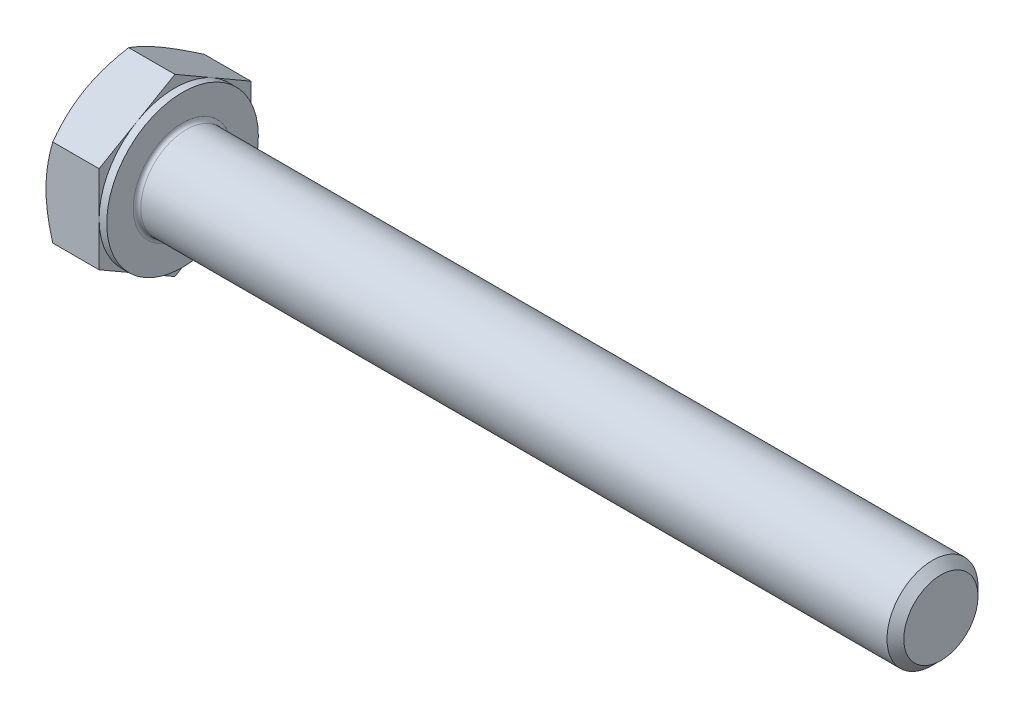
ISO-10303-21;
HEADER;
FILE_DESCRIPTION(('STEP AP214'),'2;1');
FILE_NAME('part.step','',(''),(''),'','','');
FILE_SCHEMA(('AUTOMOTIVE_DESIGN { 1 0 10303 214 1 1 1 1 }'));
ENDSEC;
DATA;
#1=APPLICATION_CONTEXT('core data for automotive mechanical design processes');
#2=APPLICATION_PROTOCOL_DEFINITION('international standard','automotive_design',2000,#1);
#3=PRODUCT_CONTEXT('',#1,'mechanical');
#4=PRODUCT('Part','Part','',(#3));
#5=PRODUCT_RELATED_PRODUCT_CATEGORY('part','',(#4));
#6=PRODUCT_DEFINITION_FORMATION('','',#4);
#7=PRODUCT_DEFINITION_CONTEXT('part definition',#1,'design');
#8=PRODUCT_DEFINITION('design','',#6,#7);
#9=PRODUCT_DEFINITION_SHAPE('','',#8);
#10=(LENGTH_UNIT() NAMED_UNIT(*) SI_UNIT(.MILLI.,.METRE.));
#11=(NAMED_UNIT(*) PLANE_ANGLE_UNIT() SI_UNIT($,.RADIAN.));
#12=(NAMED_UNIT(*) SI_UNIT($,.STERADIAN.) SOLID_ANGLE_UNIT());
#13=UNCERTAINTY_MEASURE_WITH_UNIT(LENGTH_MEASURE(1.E-05),#10,'distance_accuracy_value','');
#14=(GEOMETRIC_REPRESENTATION_CONTEXT(3) GLOBAL_UNCERTAINTY_ASSIGNED_CONTEXT((#13)) GLOBAL_UNIT_ASSIGNED_CONTEXT((#10,
#11,#12)) REPRESENTATION_CONTEXT('',''));
#15=CARTESIAN_POINT('',(0.,0.,0.));
#16=DIRECTION('',(0.,0.,1.));
#17=DIRECTION('',(1.,0.,0.));
#18=AXIS2_PLACEMENT_3D('',#15,#16,#17);
#19=CARTESIAN_POINT('',(4.,5.77350269189626,0.));
#20=DIRECTION('',(1.,0.,0.));
#21=DIRECTION('',(0.,0.,-1.));
#22=AXIS2_PLACEMENT_3D('',#19,#20,#21);
#23=PLANE('',#22);
#24=CARTESIAN_POINT('',(4.,0.,0.));
#25=DIRECTION('',(1.,0.,0.));
#26=DIRECTION('',(0.,0.,-1.));
#27=AXIS2_PLACEMENT_3D('',#24,#25,#26);
#28=CIRCLE('',#27,3.25);
#29=CARTESIAN_POINT('',(4.,0.,-3.25));
#30=VERTEX_POINT('',#29);
#31=EDGE_CURVE('E24',#30,#30,#28,.F.);
#32=ORIENTED_EDGE('',*,*,#31,.T.);
#33=EDGE_LOOP('',(#32));
#34=FACE_BOUND('',#33,.T.);
#35=CARTESIAN_POINT('',(4.,0.,0.));
#36=DIRECTION('',(1.,0.,0.));
#37=DIRECTION('',(0.,0.,-1.));
#38=AXIS2_PLACEMENT_3D('',#35,#36,#37);
#39=CIRCLE('',#38,5.);
#40=CARTESIAN_POINT('',(4.,0.,-5.));
#41=VERTEX_POINT('',#40);
#42=EDGE_CURVE('E282',#41,#41,#39,.T.);
#43=ORIENTED_EDGE('',*,*,#42,.T.);
#44=EDGE_LOOP('',(#43));
#45=FACE_BOUND('',#44,.T.);
#46=ADVANCED_FACE('F16',(#34,#45),#23,.T.);
#47=CARTESIAN_POINT('',(0.,0.,0.));
#48=DIRECTION('',(-1.,0.,0.));
#49=DIRECTION('',(0.,0.,1.));
#50=AXIS2_PLACEMENT_3D('',#47,#48,#49);
#51=CYLINDRICAL_SURFACE('',#50,3.);
#52=CARTESIAN_POINT('',(4.25,0.,0.));
#53=DIRECTION('',(1.,0.,0.));
#54=DIRECTION('',(0.,0.,-1.));
#55=AXIS2_PLACEMENT_3D('',#52,#53,#54);
#56=CIRCLE('',#55,3.);
#57=CARTESIAN_POINT('',(4.25,0.,-3.));
#58=VERTEX_POINT('',#57);
#59=EDGE_CURVE('E11',#58,#58,#56,.T.);
#60=ORIENTED_EDGE('',*,*,#59,.T.);
#61=EDGE_LOOP('',(#60));
#62=FACE_BOUND('',#61,.T.);
#63=CARTESIAN_POINT('',(53.4455,0.,0.));
#64=DIRECTION('',(-1.,0.,0.));
#65=DIRECTION('',(0.,0.,1.));
#66=AXIS2_PLACEMENT_3D('',#63,#64,#65);
#67=CIRCLE('',#66,3.);
#68=CARTESIAN_POINT('',(53.4455,0.,3.));
#69=VERTEX_POINT('',#68);
#70=EDGE_CURVE('E261',#69,#69,#67,.T.);
#71=ORIENTED_EDGE('',*,*,#70,.T.);
#72=EDGE_LOOP('',(#71));
#73=FACE_BOUND('',#72,.T.);
#74=ADVANCED_FACE('F235',(#62,#73),#51,.T.);
#75=CARTESIAN_POINT('',(54.,0.,0.));
#76=DIRECTION('',(-1.,0.,0.));
#77=DIRECTION('',(0.,0.,1.));
#78=AXIS2_PLACEMENT_3D('',#75,#76,#77);
#79=CONICAL_SURFACE('',#78,2.4455,0.785398163397435);
#80=ORIENTED_EDGE('',*,*,#70,.F.);
#81=EDGE_LOOP('',(#80));
#82=FACE_BOUND('',#81,.T.);
#83=CARTESIAN_POINT('',(54.,0.,0.));
#84=DIRECTION('',(-1.,0.,0.));
#85=DIRECTION('',(0.,0.,1.));
#86=AXIS2_PLACEMENT_3D('',#83,#84,#85);
#87=CIRCLE('',#86,2.4455);
#88=CARTESIAN_POINT('',(54.,0.,2.4455));
#89=VERTEX_POINT('',#88);
#90=EDGE_CURVE('E259',#89,#89,#87,.T.);
#91=ORIENTED_EDGE('',*,*,#90,.T.);
#92=EDGE_LOOP('',(#91));
#93=FACE_BOUND('',#92,.T.);
#94=ADVANCED_FACE('F240',(#82,#93),#79,.T.);
#95=CARTESIAN_POINT('',(54.,0.,0.));
#96=DIRECTION('',(-1.,0.,0.));
#97=DIRECTION('',(0.,0.,1.));
#98=AXIS2_PLACEMENT_3D('',#95,#96,#97);
#99=PLANE('',#98);
#100=ORIENTED_EDGE('',*,*,#90,.F.);
#101=EDGE_LOOP('',(#100));
#102=FACE_BOUND('',#101,.T.);
#103=ADVANCED_FACE('F247',(#102),#99,.F.);
#104=CARTESIAN_POINT('',(3.5,5.,0.));
#105=DIRECTION('',(1.,0.,0.));
#106=DIRECTION('',(0.,0.,-1.));
#107=AXIS2_PLACEMENT_3D('',#104,#105,#106);
#108=PLANE('',#107);
#109=DIRECTION('',(0.,0.5,0.866025403784438));
#110=VECTOR('',#109,1.);
#111=CARTESIAN_POINT('',(3.5,2.88675134594812,-5.));
#112=LINE('',#111,#110);
#113=CARTESIAN_POINT('',(3.5,2.88675134594812,-5.));
#114=VERTEX_POINT('',#113);
#115=CARTESIAN_POINT('',(3.5,4.33012701892219,-2.5));
#116=VERTEX_POINT('',#115);
#117=EDGE_CURVE('E148',#114,#116,#112,.T.);
#118=ORIENTED_EDGE('',*,*,#117,.T.);
#119=CARTESIAN_POINT('',(3.5,0.,0.));
#120=DIRECTION('',(-1.,0.,0.));
#121=DIRECTION('',(0.,0.,1.));
#122=AXIS2_PLACEMENT_3D('',#119,#120,#121);
#123=CIRCLE('',#122,5.);
#124=CARTESIAN_POINT('',(3.5,0.,-5.));
#125=VERTEX_POINT('',#124);
#126=EDGE_CURVE('E31',#116,#125,#123,.T.);
#127=ORIENTED_EDGE('',*,*,#126,.T.);
#128=DIRECTION('',(0.,1.,0.));
#129=VECTOR('',#128,1.);
#130=CARTESIAN_POINT('',(3.5,2.88675134594812,-5.));
#131=LINE('',#130,#129);
#132=EDGE_CURVE('E285',#125,#114,#131,.T.);
#133=ORIENTED_EDGE('',*,*,#132,.T.);
#134=EDGE_LOOP('',(#118,#127,#133));
#135=FACE_BOUND('',#134,.T.);
#136=ADVANCED_FACE('F250',(#135),#108,.T.);
#137=CARTESIAN_POINT('',(3.5,5.77350269189626,0.));
#138=VERTEX_POINT('',#137);
#139=EDGE_CURVE('E146',#116,#138,#112,.T.);
#140=ORIENTED_EDGE('',*,*,#139,.T.);
#141=DIRECTION('',(0.,-0.5,0.866025403784438));
#142=VECTOR('',#141,1.);
#143=CARTESIAN_POINT('',(3.5,5.77350269189626,0.));
#144=LINE('',#143,#142);
#145=CARTESIAN_POINT('',(3.5,4.33012701892219,2.5));
#146=VERTEX_POINT('',#145);
#147=EDGE_CURVE('E145',#138,#146,#144,.T.);
#148=ORIENTED_EDGE('',*,*,#147,.T.);
#149=EDGE_CURVE('E134',#146,#116,#123,.T.);
#150=ORIENTED_EDGE('',*,*,#149,.T.);
#151=EDGE_LOOP('',(#140,#148,#150));
#152=FACE_BOUND('',#151,.T.);
#153=ADVANCED_FACE('F255',(#152),#108,.T.);
#154=CARTESIAN_POINT('',(3.5,2.88675134594812,5.));
#155=VERTEX_POINT('',#154);
#156=EDGE_CURVE('E113',#146,#155,#144,.T.);
#157=ORIENTED_EDGE('',*,*,#156,.T.);
#158=DIRECTION('',(0.,-1.,0.));
#159=VECTOR('',#158,1.);
#160=CARTESIAN_POINT('',(3.5,2.88675134594812,5.));
#161=LINE('',#160,#159);
#162=CARTESIAN_POINT('',(3.5,0.,5.));
#163=VERTEX_POINT('',#162);
#164=EDGE_CURVE('E107',#155,#163,#161,.T.);
#165=ORIENTED_EDGE('',*,*,#164,.T.);
#166=EDGE_CURVE('E111',#163,#146,#123,.T.);
#167=ORIENTED_EDGE('',*,*,#166,.T.);
#168=EDGE_LOOP('',(#157,#165,#167));
#169=FACE_BOUND('',#168,.T.);
#170=ADVANCED_FACE('F109',(#169),#108,.T.);
#171=CARTESIAN_POINT('',(3.5,-2.88675134594812,5.));
#172=VERTEX_POINT('',#171);
#173=EDGE_CURVE('E117',#163,#172,#161,.T.);
#174=ORIENTED_EDGE('',*,*,#173,.T.);
#175=DIRECTION('',(0.,-0.5,-0.866025403784438));
#176=VECTOR('',#175,1.);
#177=CARTESIAN_POINT('',(3.5,-5.77350269189626,0.));
#178=LINE('',#177,#176);
#179=CARTESIAN_POINT('',(3.5,-4.33012701892219,2.5));
#180=VERTEX_POINT('',#179);
#181=EDGE_CURVE('E124',#172,#180,#178,.T.);
#182=ORIENTED_EDGE('',*,*,#181,.T.);
#183=EDGE_CURVE('E121',#180,#163,#123,.T.);
#184=ORIENTED_EDGE('',*,*,#183,.T.);
#185=EDGE_LOOP('',(#174,#182,#184));
#186=FACE_BOUND('',#185,.T.);
#187=ADVANCED_FACE('F122',(#186),#108,.T.);
#188=CARTESIAN_POINT('',(3.5,-5.77350269189626,0.));
#189=VERTEX_POINT('',#188);
#190=EDGE_CURVE('E140',#180,#189,#178,.T.);
#191=ORIENTED_EDGE('',*,*,#190,.T.);
#192=DIRECTION('',(0.,0.5,-0.866025403784439));
#193=VECTOR('',#192,1.);
#194=CARTESIAN_POINT('',(3.5,-2.88675134594813,-5.));
#195=LINE('',#194,#193);
#196=CARTESIAN_POINT('',(3.5,-4.3301270189222,-2.5));
#197=VERTEX_POINT('',#196);
#198=EDGE_CURVE('E323',#189,#197,#195,.T.);
#199=ORIENTED_EDGE('',*,*,#198,.T.);
#200=EDGE_CURVE('E128',#197,#180,#123,.T.);
#201=ORIENTED_EDGE('',*,*,#200,.T.);
#202=EDGE_LOOP('',(#191,#199,#201));
#203=FACE_BOUND('',#202,.T.);
#204=ADVANCED_FACE('F324',(#203),#108,.T.);
#205=CARTESIAN_POINT('',(3.5,-2.88675134594813,-5.));
#206=VERTEX_POINT('',#205);
#207=EDGE_CURVE('E135',#197,#206,#195,.T.);
#208=ORIENTED_EDGE('',*,*,#207,.T.);
#209=EDGE_CURVE('E286',#206,#125,#131,.T.);
#210=ORIENTED_EDGE('',*,*,#209,.T.);
#211=EDGE_CURVE('E293',#125,#197,#123,.T.);
#212=ORIENTED_EDGE('',*,*,#211,.T.);
#213=EDGE_LOOP('',(#208,#210,#212));
#214=FACE_BOUND('',#213,.T.);
#215=ADVANCED_FACE('F256',(#214),#108,.T.);
#216=CARTESIAN_POINT('',(0.,0.,0.));
#217=DIRECTION('',(-1.,0.,0.));
#218=DIRECTION('',(0.,0.,1.));
#219=AXIS2_PLACEMENT_3D('',#216,#217,#218);
#220=CYLINDRICAL_SURFACE('',#219,5.);
#221=ORIENTED_EDGE('',*,*,#126,.F.);
#222=ORIENTED_EDGE('',*,*,#149,.F.);
#223=ORIENTED_EDGE('',*,*,#166,.F.);
#224=ORIENTED_EDGE('',*,*,#183,.F.);
#225=ORIENTED_EDGE('',*,*,#200,.F.);
#226=ORIENTED_EDGE('',*,*,#211,.F.);
#227=EDGE_LOOP('',(#221,#222,#223,#224,#225,#226));
#228=FACE_BOUND('',#227,.T.);
#229=ORIENTED_EDGE('',*,*,#42,.F.);
#230=EDGE_LOOP('',(#229));
#231=FACE_BOUND('',#230,.T.);
#232=ADVANCED_FACE('F131',(#228,#231),#220,.T.);
#233=CARTESIAN_POINT('',(0.,5.77350269189626,0.));
#234=DIRECTION('',(1.,0.,0.));
#235=DIRECTION('',(0.,0.,-1.));
#236=AXIS2_PLACEMENT_3D('',#233,#234,#235);
#237=PLANE('',#236);
#238=CARTESIAN_POINT('',(0.,0.,0.));
#239=DIRECTION('',(1.,0.,0.));
#240=DIRECTION('',(0.,0.,-1.));
#241=AXIS2_PLACEMENT_3D('',#238,#239,#240);
#242=CIRCLE('',#241,5.);
#243=CARTESIAN_POINT('',(0.,0.,-5.));
#244=VERTEX_POINT('',#243);
#245=CARTESIAN_POINT('',(0.,4.33012701892219,-2.5));
#246=VERTEX_POINT('',#245);
#247=EDGE_CURVE('E281',#244,#246,#242,.T.);
#248=ORIENTED_EDGE('',*,*,#247,.F.);
#249=CARTESIAN_POINT('',(0.,-4.3301270189222,-2.5));
#250=VERTEX_POINT('',#249);
#251=EDGE_CURVE('E277',#250,#244,#242,.T.);
#252=ORIENTED_EDGE('',*,*,#251,.F.);
#253=CARTESIAN_POINT('',(0.,-4.33012701892219,2.5));
#254=VERTEX_POINT('',#253);
#255=EDGE_CURVE('E280',#254,#250,#242,.T.);
#256=ORIENTED_EDGE('',*,*,#255,.F.);
#257=CARTESIAN_POINT('',(0.,0.,5.));
#258=VERTEX_POINT('',#257);
#259=EDGE_CURVE('E316',#258,#254,#242,.T.);
#260=ORIENTED_EDGE('',*,*,#259,.F.);
#261=CARTESIAN_POINT('',(0.,0.,0.));
#262=DIRECTION('',(-1.,0.,0.));
#263=DIRECTION('',(0.,0.,1.));
#264=AXIS2_PLACEMENT_3D('',#261,#262,#263);
#265=CIRCLE('',#264,5.);
#266=CARTESIAN_POINT('',(0.,4.33012701892219,2.5));
#267=VERTEX_POINT('',#266);
#268=EDGE_CURVE('E149',#258,#267,#265,.T.);
#269=ORIENTED_EDGE('',*,*,#268,.T.);
#270=EDGE_CURVE('E339',#246,#267,#242,.T.);
#271=ORIENTED_EDGE('',*,*,#270,.F.);
#272=EDGE_LOOP('',(#248,#252,#256,#260,#269,#271));
#273=FACE_BOUND('',#272,.T.);
#274=ADVANCED_FACE('F180',(#273),#237,.F.);
#275=CARTESIAN_POINT('',(0.,0.,0.));
#276=DIRECTION('',(1.,0.,0.));
#277=DIRECTION('',(0.,0.,-1.));
#278=AXIS2_PLACEMENT_3D('',#275,#276,#277);
#279=CONICAL_SURFACE('',#278,5.,1.0471975511966);
#280=CARTESIAN_POINT('',(0.446648656051828,2.88663587589428,5.0002));
#281=CARTESIAN_POINT('',(0.373386567637635,3.01349970319368,4.78046540547482));
#282=CARTESIAN_POINT('',(0.306751321918093,3.14144859993849,4.55885141554042));
#283=CARTESIAN_POINT('',(0.190438991010812,3.39956193532121,4.11178600454649));
#284=CARTESIAN_POINT('',(0.14080304991579,3.52973095989718,3.88632664040923));
#285=CARTESIAN_POINT('',(0.0635510254186983,3.78847564779798,3.43816769477649));
#286=CARTESIAN_POINT('',(0.0354203782834897,3.91701101576052,3.21553790689581));
#287=CARTESIAN_POINT('',(0.0101949219536848,4.11026620624322,2.88081009815336));
#288=CARTESIAN_POINT('',(0.0046134597694843,4.17472868879311,2.76915780319494));
#289=CARTESIAN_POINT('',(-0.000797783248529451,4.30371322717528,2.5457500293262));
#290=CARTESIAN_POINT('',(-0.000627741741796315,4.36823528110589,2.43399455370969));
#291=CARTESIAN_POINT('',(0.00775363179203698,4.54500768479194,2.12781576914936));
#292=CARTESIAN_POINT('',(0.0218297718972523,4.65719946015293,1.93349391403279));
#293=CARTESIAN_POINT('',(0.0664652571094322,4.88083840557981,1.54613989800229));
#294=CARTESIAN_POINT('',(0.0970398601475096,4.9922847895602,1.35310909862843));
#295=CARTESIAN_POINT('',(0.173468493621166,5.21637431361295,0.964974657525145));
#296=CARTESIAN_POINT('',(0.219646378878682,5.32898917185759,0.769920001358263));
#297=CARTESIAN_POINT('',(0.324451794491937,5.55253939626498,0.38271965464123));
#298=CARTESIAN_POINT('',(0.383054703437377,5.66347762579592,0.190569004591912));
#299=CARTESIAN_POINT('',(0.446648656051831,5.7736181619501,-0.000200000000000734));
#300=B_SPLINE_CURVE_WITH_KNOTS('',3,(#280,#281,#282,#283,#284,#285,#286,#287,#288,#289,#290,
#291,#292,#293,#294,#295,#296,#297,#298,#299),.UNSPECIFIED.,.F.,.F.,(4,2,2,2,2,2,2,2,2,4),(0.,
0.792555841363091,1.58701660053334,2.36181537487281,2.74884076077326,3.13585419177295,
3.8096236259968,4.4840172390119,5.17336882348929,5.86136694793726),.UNSPECIFIED.);
#301=CARTESIAN_POINT('',(0.446581987385204,5.77350269189626,0.));
#302=VERTEX_POINT('',#301);
#303=EDGE_CURVE('E200',#267,#302,#300,.T.);
#304=ORIENTED_EDGE('',*,*,#303,.T.);
#305=CARTESIAN_POINT('',(0.446648656051831,5.7736181619501,0.000199999999999791));
#306=CARTESIAN_POINT('',(0.373386567637636,5.64675433465071,-0.219534594525184));
#307=CARTESIAN_POINT('',(0.306751321918093,5.5188054379059,-0.441148584459579));
#308=CARTESIAN_POINT('',(0.190438991010811,5.26069210252318,-0.888213995453511));
#309=CARTESIAN_POINT('',(0.140803049915789,5.13052307794721,-1.11367335959077));
#310=CARTESIAN_POINT('',(0.0635510254186972,4.87177839004641,-1.56183230522351));
#311=CARTESIAN_POINT('',(0.0354203782834882,4.74324302208387,-1.78446209310419));
#312=CARTESIAN_POINT('',(0.0101949219536831,4.54998783160116,-2.11918990184664));
#313=CARTESIAN_POINT('',(0.00461345976948256,4.48552534905128,-2.23084219680506));
#314=CARTESIAN_POINT('',(-0.000797783248530469,4.35654081066911,-2.4542499706738));
#315=CARTESIAN_POINT('',(-0.000627741741796585,4.2920187567385,-2.56600544629031));
#316=CARTESIAN_POINT('',(0.00775363179203711,4.11524635305244,-2.87218423085064));
#317=CARTESIAN_POINT('',(0.0218297718972509,4.00305457769146,-3.06650608596721));
#318=CARTESIAN_POINT('',(0.0664652571094294,3.77941563226457,-3.45386010199771));
#319=CARTESIAN_POINT('',(0.0970398601475071,3.66796924828418,-3.64689090137157));
#320=CARTESIAN_POINT('',(0.173468493621163,3.44387972423143,-4.03502534247485));
#321=CARTESIAN_POINT('',(0.21964637887868,3.3312648659868,-4.23007999864174));
#322=CARTESIAN_POINT('',(0.324451794491934,3.1077146415794,-4.61728034535877));
#323=CARTESIAN_POINT('',(0.383054703437374,2.99677641204846,-4.80943099540809));
#324=CARTESIAN_POINT('',(0.446648656051828,2.88663587589428,-5.0002));
#325=B_SPLINE_CURVE_WITH_KNOTS('',3,(#305,#306,#307,#308,#309,#310,#311,#312,#313,#314,#315,
#316,#317,#318,#319,#320,#321,#322,#323,#324),.UNSPECIFIED.,.F.,.F.,(4,2,2,2,2,2,2,2,2,4),(0.,
0.792555841363091,1.58701660053334,2.36181537487281,2.74884076077326,3.13585419177295,
3.8096236259968,4.4840172390119,5.17336882348929,5.86136694793726),.UNSPECIFIED.);
#326=EDGE_CURVE('E39',#302,#246,#325,.T.);
#327=ORIENTED_EDGE('',*,*,#326,.T.);
#328=ORIENTED_EDGE('',*,*,#270,.T.);
#329=EDGE_LOOP('',(#304,#327,#328));
#330=FACE_BOUND('',#329,.T.);
#331=ADVANCED_FACE('F340',(#330),#279,.T.);
#332=CARTESIAN_POINT('',(2.47533544689295,-7.82661640313889,5.));
#333=CARTESIAN_POINT('',(2.36879683507773,-7.60758613024921,5.));
#334=CARTESIAN_POINT('',(2.26325911833056,-7.38806071364409,5.));
#335=CARTESIAN_POINT('',(2.05474707865951,-6.94775649535432,5.));
#336=CARTESIAN_POINT('',(1.95177314617003,-6.72697750897687,5.));
#337=CARTESIAN_POINT('',(1.74844778545275,-6.28280027125596,5.));
#338=CARTESIAN_POINT('',(1.64811306490869,-6.05939434592712,5.));
#339=CARTESIAN_POINT('',(1.45145486004312,-5.61083043832919,5.));
#340=CARTESIAN_POINT('',(1.35513119080617,-5.38567253739804,5.));
#341=CARTESIAN_POINT('',(1.1644503760596,-4.92576614780202,5.));
#342=CARTESIAN_POINT('',(1.07026351405996,-4.69094667859484,5.));
#343=CARTESIAN_POINT('',(0.888844387350837,-4.21858752735361,5.));
#344=CARTESIAN_POINT('',(0.801612892640659,-3.98104754746316,5.));
#345=CARTESIAN_POINT('',(0.636341071883239,-3.50329086404363,5.));
#346=CARTESIAN_POINT('',(0.55828276514971,-3.26308044250486,5.));
#347=CARTESIAN_POINT('',(0.413813856737664,-2.77921467819531,5.));
#348=CARTESIAN_POINT('',(0.347399663631973,-2.53556042275998,5.));
#349=CARTESIAN_POINT('',(0.229707450535049,-2.04600448312502,5.));
#350=CARTESIAN_POINT('',(0.178346573442477,-1.80012308686183,5.));
#351=CARTESIAN_POINT('',(0.0936230804935142,-1.30522837494365,5.));
#352=CARTESIAN_POINT('',(0.0602585789244914,-1.05621539022477,5.));
#353=CARTESIAN_POINT('',(0.0146229933804837,-0.559584253783063,5.));
#354=CARTESIAN_POINT('',(0.0020749850658407,-0.31199219296767,5.));
#355=CARTESIAN_POINT('',(-0.00159747165030484,0.183375584056742,5.));
#356=CARTESIAN_POINT('',(0.00727849448086307,0.431151303726645,5.));
#357=CARTESIAN_POINT('',(0.0397265053205849,0.849622860758232,5.));
#358=CARTESIAN_POINT('',(0.0579847912618802,1.02075746544157,5.));
#359=CARTESIAN_POINT('',(0.103624049996723,1.3618139875752,5.));
#360=CARTESIAN_POINT('',(0.131006199082926,1.53173574577271,5.));
#361=CARTESIAN_POINT('',(0.225403333816325,2.03942834541587,5.));
#362=CARTESIAN_POINT('',(0.30465362110404,2.37495177168564,5.));
#363=CARTESIAN_POINT('',(0.442611792168644,2.87686006020152,5.));
#364=CARTESIAN_POINT('',(0.492453035928122,3.04583048582566,5.));
#365=CARTESIAN_POINT('',(0.597441969480146,3.3821306103866,5.));
#366=CARTESIAN_POINT('',(0.652589698776811,3.5494602970987,5.));
#367=CARTESIAN_POINT('',(0.767295730006404,3.88253122341818,5.));
#368=CARTESIAN_POINT('',(0.826852713137823,4.04827292137365,5.));
#369=CARTESIAN_POINT('',(0.949663499110058,4.37837269604184,5.));
#370=CARTESIAN_POINT('',(1.01291722636638,4.54273080096527,5.));
#371=CARTESIAN_POINT('',(1.18384085306905,4.9746759403977,5.));
#372=CARTESIAN_POINT('',(1.29410564783454,5.24123504256649,5.));
#373=CARTESIAN_POINT('',(1.52085041203994,5.77170603526335,5.));
#374=CARTESIAN_POINT('',(1.63733099805398,6.03561766007929,5.));
#375=CARTESIAN_POINT('',(1.87507624393349,6.56138078778337,5.));
#376=CARTESIAN_POINT('',(1.99634255328239,6.82323154239329,5.));
#377=CARTESIAN_POINT('',(2.24254703861693,7.34518395602015,5.));
#378=CARTESIAN_POINT('',(2.36748508200603,7.60528567778374,5.));
#379=CARTESIAN_POINT('',(2.62044102887899,8.12446478659921,5.));
#380=CARTESIAN_POINT('',(2.74846325062127,8.38354006552432,5.));
#381=CARTESIAN_POINT('',(3.0068266896755,8.90053291127539,5.));
#382=CARTESIAN_POINT('',(3.13716793074433,9.15845046620728,5.));
#383=CARTESIAN_POINT('',(3.53092424591318,9.93067662274978,5.));
#384=CARTESIAN_POINT('',(3.79712405172276,10.4435647238032,5.));
#385=CARTESIAN_POINT('',(4.30724046881172,11.4147548711531,5.));
#386=CARTESIAN_POINT('',(4.55067498762246,11.873311348306,5.));
#387=CARTESIAN_POINT('',(5.04052915785299,12.7888590468283,5.));
#388=CARTESIAN_POINT('',(5.28694897482745,13.2458501795696,5.));
#389=CARTESIAN_POINT('',(5.78122505346441,14.1571829390173,5.));
#390=CARTESIAN_POINT('',(6.02907430461247,14.6115283739736,5.));
#391=CARTESIAN_POINT('',(6.52648185519852,15.5192398746589,5.));
#392=CARTESIAN_POINT('',(6.77604002809908,15.9726060096992,5.));
#393=CARTESIAN_POINT('',(7.02622264559118,16.4256251044156,5.));
#394=B_SPLINE_CURVE_WITH_KNOTS('',3,(#332,#333,#334,#335,#336,#337,#338,#339,#340,#341,#342,
#343,#344,#345,#346,#347,#348,#349,#350,#351,#352,#353,#354,#355,#356,#357,#358,#359,#360,#361,
#362,#363,#364,#365,#366,#367,#368,#369,#370,#371,#372,#373,#374,#375,#376,#377,#378,#379,#380,
#381,#382,#383,#384,#385,#386,#387,#388,#389,#390,#391,#392,#393),.UNSPECIFIED.,.F.,.F.,(4,2,2,
2,2,2,2,2,2,2,2,2,2,2,2,2,2,2,2,2,2,2,2,2,2,2,2,2,2,2,4),(0.,0.730708682143099,1.46152797033751,
2.19620403652929,2.930846195478,3.68977491658213,4.44878753915767,5.20628666210827,
5.9635517348485,6.71656679485872,7.46950293642267,8.21233991237299,8.95519126159773,
9.47125991232469,9.98739512288342,11.0201893937443,11.5486465414698,12.0771076235976,
12.6054112774226,13.1337041332035,13.9989833719716,14.8643486020619,15.7300147459346,
16.5956496665091,17.4625765068272,18.3295122333794,20.0630293163822,21.6205191219182,
23.1780956996636,24.7307447704824,26.2832800921358),.UNSPECIFIED.);
#395=CARTESIAN_POINT('',(0.446581987385201,2.88675134594812,5.));
#396=VERTEX_POINT('',#395);
#397=EDGE_CURVE('E214',#258,#396,#394,.T.);
#398=ORIENTED_EDGE('',*,*,#397,.T.);
#399=EDGE_CURVE('E213',#396,#267,#300,.T.);
#400=ORIENTED_EDGE('',*,*,#399,.T.);
#401=ORIENTED_EDGE('',*,*,#268,.F.);
#402=EDGE_LOOP('',(#398,#400,#401));
#403=FACE_BOUND('',#402,.T.);
#404=ADVANCED_FACE('F310',(#403),#279,.T.);
#405=CARTESIAN_POINT('',(0.446581987385199,-2.88675134594812,5.));
#406=VERTEX_POINT('',#405);
#407=EDGE_CURVE('E262',#406,#258,#394,.T.);
#408=ORIENTED_EDGE('',*,*,#407,.T.);
#409=ORIENTED_EDGE('',*,*,#259,.T.);
#410=CARTESIAN_POINT('',(0.446648656051831,-5.7736181619501,-0.000200000000000052));
#411=CARTESIAN_POINT('',(0.373386567637637,-5.64675433465071,0.219534594525185));
#412=CARTESIAN_POINT('',(0.306751321918094,-5.5188054379059,0.44114858445958));
#413=CARTESIAN_POINT('',(0.190438991010813,-5.26069210252318,0.888213995453512));
#414=CARTESIAN_POINT('',(0.14080304991579,-5.13052307794721,1.11367335959077));
#415=CARTESIAN_POINT('',(0.0635510254186987,-4.87177839004641,1.56183230522351));
#416=CARTESIAN_POINT('',(0.0354203782834898,-4.74324302208387,1.78446209310419));
#417=CARTESIAN_POINT('',(0.0101949219536851,-4.54998783160116,2.11918990184664));
#418=CARTESIAN_POINT('',(0.00461345976948479,-4.48552534905128,2.23084219680506));
#419=CARTESIAN_POINT('',(-0.000797783248529952,-4.35654081066911,2.4542499706738));
#420=CARTESIAN_POINT('',(-0.000627741741797981,-4.2920187567385,2.56600544629031));
#421=CARTESIAN_POINT('',(0.0077536317920344,-4.11524635305244,2.87218423085064));
#422=CARTESIAN_POINT('',(0.0218297718972517,-4.00305457769146,3.06650608596721));
#423=CARTESIAN_POINT('',(0.0664652571094326,-3.77941563226457,3.45386010199771));
#424=CARTESIAN_POINT('',(0.0970398601475093,-3.66796924828418,3.64689090137157));
#425=CARTESIAN_POINT('',(0.173468493621165,-3.44387972423144,4.03502534247486));
#426=CARTESIAN_POINT('',(0.219646378878683,-3.3312648659868,4.23007999864174));
#427=CARTESIAN_POINT('',(0.324451794491936,-3.1077146415794,4.61728034535877));
#428=CARTESIAN_POINT('',(0.383054703437375,-2.99677641204846,4.80943099540809));
#429=CARTESIAN_POINT('',(0.446648656051826,-2.88663587589428,5.0002));
#430=B_SPLINE_CURVE_WITH_KNOTS('',3,(#410,#411,#412,#413,#414,#415,#416,#417,#418,#419,#420,
#421,#422,#423,#424,#425,#426,#427,#428,#429),.UNSPECIFIED.,.F.,.F.,(4,2,2,2,2,2,2,2,2,4),(0.,
0.79255584136309,1.58701660053334,2.36181537487281,2.74884076077326,3.13585419177295,
3.80962362599679,4.4840172390119,5.17336882348929,5.86136694793726),.UNSPECIFIED.);
#431=EDGE_CURVE('E202',#254,#406,#430,.T.);
#432=ORIENTED_EDGE('',*,*,#431,.T.);
#433=EDGE_LOOP('',(#408,#409,#432));
#434=FACE_BOUND('',#433,.T.);
#435=ADVANCED_FACE('F169',(#434),#279,.T.);
#436=CARTESIAN_POINT('',(0.446581987385204,-5.77350269189626,0.));
#437=VERTEX_POINT('',#436);
#438=EDGE_CURVE('E194',#437,#254,#430,.T.);
#439=ORIENTED_EDGE('',*,*,#438,.T.);
#440=ORIENTED_EDGE('',*,*,#255,.T.);
#441=CARTESIAN_POINT('',(0.446648656051831,-2.88663587589429,-5.0002));
#442=CARTESIAN_POINT('',(0.373386567637638,-3.01349970319368,-4.78046540547481));
#443=CARTESIAN_POINT('',(0.306751321918095,-3.1414485999385,-4.55885141554042));
#444=CARTESIAN_POINT('',(0.190438991010814,-3.39956193532121,-4.11178600454649));
#445=CARTESIAN_POINT('',(0.140803049915792,-3.52973095989718,-3.88632664040923));
#446=CARTESIAN_POINT('',(0.063551025418701,-3.78847564779798,-3.43816769477649));
#447=CARTESIAN_POINT('',(0.0354203782834925,-3.91701101576052,-3.21553790689581));
#448=CARTESIAN_POINT('',(0.0101949219536874,-4.11026620624323,-2.88081009815336));
#449=CARTESIAN_POINT('',(0.00461345976948665,-4.17472868879311,-2.76915780319494));
#450=CARTESIAN_POINT('',(-0.000797783248527054,-4.30371322717528,-2.5457500293262));
#451=CARTESIAN_POINT('',(-0.000627741741793657,-4.36823528110589,-2.43399455370969));
#452=CARTESIAN_POINT('',(0.00775363179203989,-4.54500768479195,-2.12781576914936));
#453=CARTESIAN_POINT('',(0.0218297718972548,-4.65719946015293,-1.93349391403279));
#454=CARTESIAN_POINT('',(0.0664652571094341,-4.88083840557982,-1.5461398980023));
#455=CARTESIAN_POINT('',(0.0970398601475114,-4.99228478956021,-1.35310909862843));
#456=CARTESIAN_POINT('',(0.173468493621167,-5.21637431361295,-0.964974657525146));
#457=CARTESIAN_POINT('',(0.219646378878684,-5.32898917185759,-0.769920001358265));
#458=CARTESIAN_POINT('',(0.324451794491938,-5.55253939626499,-0.382719654641233));
#459=CARTESIAN_POINT('',(0.383054703437378,-5.66347762579592,-0.190569004591915));
#460=CARTESIAN_POINT('',(0.446648656051831,-5.7736181619501,0.00019999999999929));
#461=B_SPLINE_CURVE_WITH_KNOTS('',3,(#441,#442,#443,#444,#445,#446,#447,#448,#449,#450,#451,
#452,#453,#454,#455,#456,#457,#458,#459,#460),.UNSPECIFIED.,.F.,.F.,(4,2,2,2,2,2,2,2,2,4),(0.,
0.792555841363091,1.58701660053333,2.3618153748728,2.74884076077325,3.13585419177295,
3.80962362599679,4.48401723901189,5.17336882348928,5.86136694793725),.UNSPECIFIED.);
#462=EDGE_CURVE('E201',#250,#437,#461,.T.);
#463=ORIENTED_EDGE('',*,*,#462,.T.);
#464=EDGE_LOOP('',(#439,#440,#463));
#465=FACE_BOUND('',#464,.T.);
#466=ADVANCED_FACE('F338',(#465),#279,.T.);
#467=CARTESIAN_POINT('',(0.446581987385201,2.88675134594812,-5.));
#468=VERTEX_POINT('',#467);
#469=EDGE_CURVE('E203',#246,#468,#325,.T.);
#470=ORIENTED_EDGE('',*,*,#469,.T.);
#471=CARTESIAN_POINT('',(2.47533544773018,-7.82661640485967,-5.));
#472=CARTESIAN_POINT('',(2.36879683588001,-7.60758613191209,-5.));
#473=CARTESIAN_POINT('',(2.26325911909791,-7.38806071524903,-5.));
#474=CARTESIAN_POINT('',(2.05474707935717,-6.94775649684319,-5.));
#475=CARTESIAN_POINT('',(1.95177314683292,-6.72697751040762,-5.));
#476=CARTESIAN_POINT('',(1.74844778604609,-6.28280027256958,-5.));
#477=CARTESIAN_POINT('',(1.64811306546725,-6.05939434718172,-5.));
#478=CARTESIAN_POINT('',(1.4514548605327,-5.61083043946536,-5.));
#479=CARTESIAN_POINT('',(1.35513119126155,-5.38567253847479,-5.));
#480=CARTESIAN_POINT('',(1.16445037644562,-4.92576614875538,-5.));
#481=CARTESIAN_POINT('',(1.07026351441089,-4.69094667948418,-5.));
#482=CARTESIAN_POINT('',(0.888844387633478,-4.21858752811391,-5.));
#483=CARTESIAN_POINT('',(0.80161289289009,-3.98104754815841,-5.));
#484=CARTESIAN_POINT('',(0.636341072069428,-3.50329086460758,-5.));
#485=CARTESIAN_POINT('',(0.558282765305857,-3.26308044300257,-5.));
#486=CARTESIAN_POINT('',(0.413813856838632,-2.77921467855872,-5.));
#487=CARTESIAN_POINT('',(0.3473996637078,-2.53556042305535,-5.));
#488=CARTESIAN_POINT('',(0.229707450560149,-2.04600448324933,-5.));
#489=CARTESIAN_POINT('',(0.178346573443939,-1.80012308688265,-5.));
#490=CARTESIAN_POINT('',(0.0936230804633195,-1.305228374755,-5.));
#491=CARTESIAN_POINT('',(0.0602585788862662,-1.05621538993014,-5.));
#492=CARTESIAN_POINT('',(0.0146229933450854,-0.559584253278232,-5.));
#493=CARTESIAN_POINT('',(0.00207498504095135,-0.311992192358636,-5.));
#494=CARTESIAN_POINT('',(-0.00159747163599387,0.183375584872588,-5.));
#495=CARTESIAN_POINT('',(0.00727849452387024,0.431151304645098,-5.));
#496=CARTESIAN_POINT('',(0.0397265054214782,0.84962286180559,-5.));
#497=CARTESIAN_POINT('',(0.0579847913857297,1.02075746651638,-5.));
#498=CARTESIAN_POINT('',(0.103624050167706,1.3618139887037,-5.));
#499=CARTESIAN_POINT('',(0.131006199278086,1.53173574692745,-5.));
#500=CARTESIAN_POINT('',(0.225403334084526,2.03942834664787,-5.));
#501=CARTESIAN_POINT('',(0.304653621421582,2.37495177296713,-5.));
#502=CARTESIAN_POINT('',(0.442611792559001,2.87686006155704,-5.));
#503=CARTESIAN_POINT('',(0.492453036342919,3.04583048720638,-5.));
#504=CARTESIAN_POINT('',(0.59744196994308,3.38213061181744,-5.));
#505=CARTESIAN_POINT('',(0.652589699263441,3.54946029855447,-5.));
#506=CARTESIAN_POINT('',(0.767295730539582,3.88253122492361,-5.));
#507=CARTESIAN_POINT('',(0.826852713693852,4.04827292290383,-5.));
#508=CARTESIAN_POINT('',(0.949663499710998,4.3783726976215,-5.));
#509=CARTESIAN_POINT('',(1.01291722698938,4.54273080256967,-5.));
#510=CARTESIAN_POINT('',(1.18384085372923,4.97467594201676,-5.));
#511=CARTESIAN_POINT('',(1.29410564850766,5.24123504417614,-5.));
#512=CARTESIAN_POINT('',(1.52085041273531,5.77170603685537,-5.));
#513=CARTESIAN_POINT('',(1.63733099875866,6.03561766166309,-5.));
#514=CARTESIAN_POINT('',(1.87507624465414,6.56138078935162,-5.));
#515=CARTESIAN_POINT('',(1.99634255400968,6.82323154395419,-5.));
#516=CARTESIAN_POINT('',(2.24254703935563,7.34518395756715,-5.));
#517=CARTESIAN_POINT('',(2.36748508274947,7.60528567932418,-5.));
#518=CARTESIAN_POINT('',(2.62044102963035,8.12446478812676,-5.));
#519=CARTESIAN_POINT('',(2.74846325137579,8.38354006704553,-5.));
#520=CARTESIAN_POINT('',(3.00682669043529,8.90053291278441,-5.));
#521=CARTESIAN_POINT('',(3.13716793150622,9.15845046771044,-5.));
#522=CARTESIAN_POINT('',(3.53092424668024,9.93067662423605,-5.));
#523=CARTESIAN_POINT('',(3.7971240524917,10.443564725279,-5.));
#524=CARTESIAN_POINT('',(4.30724046958689,11.4147548726184,-5.));
#525=CARTESIAN_POINT('',(4.55067498840225,11.8733113497711,-5.));
#526=CARTESIAN_POINT('',(5.04052915864106,12.7888590482936,-5.));
#527=CARTESIAN_POINT('',(5.28694897561918,13.2458501810351,-5.));
#528=CARTESIAN_POINT('',(5.78122505426361,14.1571829404851,-5.));
#529=CARTESIAN_POINT('',(6.02907430541547,14.6115283754434,-5.));
#530=CARTESIAN_POINT('',(6.5264818560087,15.519239876133,-5.));
#531=CARTESIAN_POINT('',(6.77604002891262,15.9726060111756,-5.));
#532=CARTESIAN_POINT('',(7.02622264640795,16.4256251058944,-5.));
#533=B_SPLINE_CURVE_WITH_KNOTS('',3,(#471,#472,#473,#474,#475,#476,#477,#478,#479,#480,#481,
#482,#483,#484,#485,#486,#487,#488,#489,#490,#491,#492,#493,#494,#495,#496,#497,#498,#499,#500,
#501,#502,#503,#504,#505,#506,#507,#508,#509,#510,#511,#512,#513,#514,#515,#516,#517,#518,#519,
#520,#521,#522,#523,#524,#525,#526,#527,#528,#529,#530,#531,#532),.UNSPECIFIED.,.F.,.F.,(4,2,2,
2,2,2,2,2,2,2,2,2,2,2,2,2,2,2,2,2,2,2,2,2,2,2,2,2,2,2,4),(0.,0.730708682345173,1.46152797074168,
2.19620403713772,2.93084619629067,3.6897749176122,4.44878754040521,5.20628666357256,
5.96355173652936,6.7165667968573,7.46950293873851,8.21233991499825,8.95519126453256,
9.47125991534871,9.98739512599665,11.0201893970363,11.5486465448551,12.0771076270762,
12.6054112809942,13.1337041368682,13.9989833756252,14.8643486057043,15.7300147495654,
16.5956496701284,17.4625765104336,18.329512236973,20.0630293199506,21.6205191254926,
23.178095703244,24.7307447740735,26.2832800957379),.UNSPECIFIED.);
#534=EDGE_CURVE('E161',#468,#244,#533,.F.);
#535=ORIENTED_EDGE('',*,*,#534,.T.);
#536=ORIENTED_EDGE('',*,*,#247,.T.);
#537=EDGE_LOOP('',(#470,#535,#536));
#538=FACE_BOUND('',#537,.T.);
#539=ADVANCED_FACE('F335',(#538),#279,.T.);
#540=CARTESIAN_POINT('',(0.44658198738495,-2.88675134594852,-5.));
#541=VERTEX_POINT('',#540);
#542=EDGE_CURVE('E162',#541,#250,#461,.T.);
#543=ORIENTED_EDGE('',*,*,#542,.T.);
#544=ORIENTED_EDGE('',*,*,#251,.T.);
#545=EDGE_CURVE('E152',#244,#541,#533,.F.);
#546=ORIENTED_EDGE('',*,*,#545,.T.);
#547=EDGE_LOOP('',(#543,#544,#546));
#548=FACE_BOUND('',#547,.T.);
#549=ADVANCED_FACE('F178',(#548),#279,.T.);
#550=CARTESIAN_POINT('',(4.,2.88675134594812,-5.));
#551=DIRECTION('',(0.,0.,1.));
#552=DIRECTION('',(0.,-1.,0.));
#553=AXIS2_PLACEMENT_3D('',#550,#551,#552);
#554=PLANE('',#553);
#555=ORIENTED_EDGE('',*,*,#209,.F.);
#556=DIRECTION('',(-1.,0.,0.));
#557=VECTOR('',#556,1.);
#558=CARTESIAN_POINT('',(4.,-2.88675134594813,-5.));
#559=LINE('',#558,#557);
#560=EDGE_CURVE('E268',#206,#541,#559,.T.);
#561=ORIENTED_EDGE('',*,*,#560,.T.);
#562=ORIENTED_EDGE('',*,*,#545,.F.);
#563=ORIENTED_EDGE('',*,*,#534,.F.);
#564=DIRECTION('',(-1.,0.,0.));
#565=VECTOR('',#564,1.);
#566=CARTESIAN_POINT('',(4.,2.88675134594812,-5.));
#567=LINE('',#566,#565);
#568=EDGE_CURVE('E264',#114,#468,#567,.T.);
#569=ORIENTED_EDGE('',*,*,#568,.F.);
#570=ORIENTED_EDGE('',*,*,#132,.F.);
#571=EDGE_LOOP('',(#555,#561,#562,#563,#569,#570));
#572=FACE_BOUND('',#571,.T.);
#573=ADVANCED_FACE('F173',(#572),#554,.F.);
#574=CARTESIAN_POINT('',(4.,-2.88675134594813,-5.));
#575=DIRECTION('',(0.,0.866025403784439,0.5));
#576=DIRECTION('',(0.,-0.5,0.866025403784439));
#577=AXIS2_PLACEMENT_3D('',#574,#575,#576);
#578=PLANE('',#577);
#579=ORIENTED_EDGE('',*,*,#198,.F.);
#580=DIRECTION('',(-1.,0.,0.));
#581=VECTOR('',#580,1.);
#582=CARTESIAN_POINT('',(4.,-5.77350269189626,0.));
#583=LINE('',#582,#581);
#584=EDGE_CURVE('E270',#189,#437,#583,.T.);
#585=ORIENTED_EDGE('',*,*,#584,.T.);
#586=ORIENTED_EDGE('',*,*,#462,.F.);
#587=ORIENTED_EDGE('',*,*,#542,.F.);
#588=ORIENTED_EDGE('',*,*,#560,.F.);
#589=ORIENTED_EDGE('',*,*,#207,.F.);
#590=EDGE_LOOP('',(#579,#585,#586,#587,#588,#589));
#591=FACE_BOUND('',#590,.T.);
#592=ADVANCED_FACE('F177',(#591),#578,.F.);
#593=CARTESIAN_POINT('',(4.,-5.77350269189626,0.));
#594=DIRECTION('',(0.,0.866025403784438,-0.5));
#595=DIRECTION('',(0.,0.5,0.866025403784438));
#596=AXIS2_PLACEMENT_3D('',#593,#594,#595);
#597=PLANE('',#596);
#598=ORIENTED_EDGE('',*,*,#181,.F.);
#599=DIRECTION('',(-1.,0.,0.));
#600=VECTOR('',#599,1.);
#601=CARTESIAN_POINT('',(4.,-2.88675134594812,5.));
#602=LINE('',#601,#600);
#603=EDGE_CURVE('E139',#172,#406,#602,.T.);
#604=ORIENTED_EDGE('',*,*,#603,.T.);
#605=ORIENTED_EDGE('',*,*,#431,.F.);
#606=ORIENTED_EDGE('',*,*,#438,.F.);
#607=ORIENTED_EDGE('',*,*,#584,.F.);
#608=ORIENTED_EDGE('',*,*,#190,.F.);
#609=EDGE_LOOP('',(#598,#604,#605,#606,#607,#608));
#610=FACE_BOUND('',#609,.T.);
#611=ADVANCED_FACE('F185',(#610),#597,.F.);
#612=CARTESIAN_POINT('',(4.,2.88675134594812,5.));
#613=DIRECTION('',(0.,0.,-1.));
#614=DIRECTION('',(0.,1.,0.));
#615=AXIS2_PLACEMENT_3D('',#612,#613,#614);
#616=PLANE('',#615);
#617=ORIENTED_EDGE('',*,*,#164,.F.);
#618=DIRECTION('',(-1.,0.,0.));
#619=VECTOR('',#618,1.);
#620=CARTESIAN_POINT('',(4.,2.88675134594812,5.));
#621=LINE('',#620,#619);
#622=EDGE_CURVE('E273',#155,#396,#621,.T.);
#623=ORIENTED_EDGE('',*,*,#622,.T.);
#624=ORIENTED_EDGE('',*,*,#397,.F.);
#625=ORIENTED_EDGE('',*,*,#407,.F.);
#626=ORIENTED_EDGE('',*,*,#603,.F.);
#627=ORIENTED_EDGE('',*,*,#173,.F.);
#628=EDGE_LOOP('',(#617,#623,#624,#625,#626,#627));
#629=FACE_BOUND('',#628,.T.);
#630=ADVANCED_FACE('F137',(#629),#616,.F.);
#631=CARTESIAN_POINT('',(4.,5.77350269189626,0.));
#632=DIRECTION('',(0.,-0.866025403784438,-0.5));
#633=DIRECTION('',(0.,0.5,-0.866025403784438));
#634=AXIS2_PLACEMENT_3D('',#631,#632,#633);
#635=PLANE('',#634);
#636=ORIENTED_EDGE('',*,*,#147,.F.);
#637=DIRECTION('',(-1.,0.,0.));
#638=VECTOR('',#637,1.);
#639=CARTESIAN_POINT('',(4.,5.77350269189626,0.));
#640=LINE('',#639,#638);
#641=EDGE_CURVE('E275',#138,#302,#640,.T.);
#642=ORIENTED_EDGE('',*,*,#641,.T.);
#643=ORIENTED_EDGE('',*,*,#303,.F.);
#644=ORIENTED_EDGE('',*,*,#399,.F.);
#645=ORIENTED_EDGE('',*,*,#622,.F.);
#646=ORIENTED_EDGE('',*,*,#156,.F.);
#647=EDGE_LOOP('',(#636,#642,#643,#644,#645,#646));
#648=FACE_BOUND('',#647,.T.);
#649=ADVANCED_FACE('F220',(#648),#635,.F.);
#650=CARTESIAN_POINT('',(4.,2.88675134594812,-5.));
#651=DIRECTION('',(0.,-0.866025403784438,0.5));
#652=DIRECTION('',(0.,-0.5,-0.866025403784438));
#653=AXIS2_PLACEMENT_3D('',#650,#651,#652);
#654=PLANE('',#653);
#655=ORIENTED_EDGE('',*,*,#117,.F.);
#656=ORIENTED_EDGE('',*,*,#568,.T.);
#657=ORIENTED_EDGE('',*,*,#469,.F.);
#658=ORIENTED_EDGE('',*,*,#326,.F.);
#659=ORIENTED_EDGE('',*,*,#641,.F.);
#660=ORIENTED_EDGE('',*,*,#139,.F.);
#661=EDGE_LOOP('',(#655,#656,#657,#658,#659,#660));
#662=FACE_BOUND('',#661,.T.);
#663=ADVANCED_FACE('F223',(#662),#654,.F.);
#664=CARTESIAN_POINT('',(4.25,0.,0.));
#665=DIRECTION('',(1.,0.,0.));
#666=DIRECTION('',(0.,0.,-1.));
#667=AXIS2_PLACEMENT_3D('',#664,#665,#666);
#668=TOROIDAL_SURFACE('',#667,3.25,0.25);
#669=ORIENTED_EDGE('',*,*,#59,.F.);
#670=EDGE_LOOP('',(#669));
#671=FACE_BOUND('',#670,.T.);
#672=ORIENTED_EDGE('',*,*,#31,.F.);
#673=EDGE_LOOP('',(#672));
#674=FACE_BOUND('',#673,.T.);
#675=ADVANCED_FACE('F18',(#671,#674),#668,.F.);
#676=CLOSED_SHELL('',(#46,#74,#94,#103,#136,#153,#170,#187,#204,#215,#232,#274,#331,#404,#435,
#466,#539,#549,#573,#592,#611,#630,#649,#663,#675));
#677=MANIFOLD_SOLID_BREP('B1',#676);
#678=ADVANCED_BREP_SHAPE_REPRESENTATION('',(#18,#677),#14);
#679=SHAPE_DEFINITION_REPRESENTATION(#9,#678);
ENDSEC;
END-ISO-10303-21;
